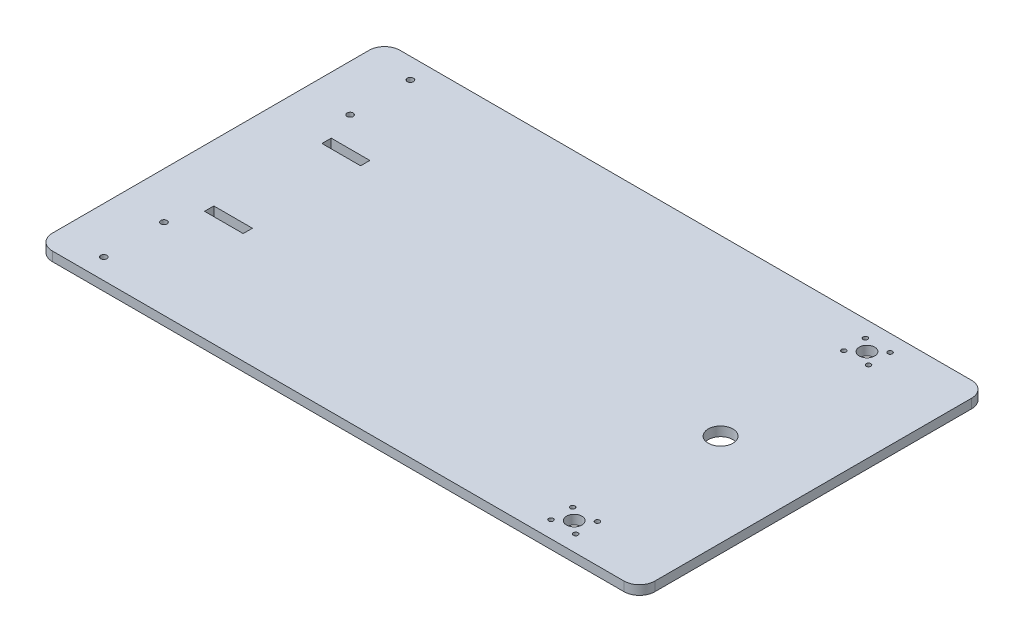
ISO-10303-21;
HEADER;
FILE_DESCRIPTION(('STEP AP214'),'2;1');
FILE_NAME('part.step','',(''),(''),'','','');
FILE_SCHEMA(('AUTOMOTIVE_DESIGN { 1 0 10303 214 1 1 1 1 }'));
ENDSEC;
DATA;
#1=APPLICATION_CONTEXT('core data for automotive mechanical design processes');
#2=APPLICATION_PROTOCOL_DEFINITION('international standard','automotive_design',2000,#1);
#3=PRODUCT_CONTEXT('',#1,'mechanical');
#4=PRODUCT('Part','Part','',(#3));
#5=PRODUCT_RELATED_PRODUCT_CATEGORY('part','',(#4));
#6=PRODUCT_DEFINITION_FORMATION('','',#4);
#7=PRODUCT_DEFINITION_CONTEXT('part definition',#1,'design');
#8=PRODUCT_DEFINITION('design','',#6,#7);
#9=PRODUCT_DEFINITION_SHAPE('','',#8);
#10=(LENGTH_UNIT() NAMED_UNIT(*) SI_UNIT(.MILLI.,.METRE.));
#11=(NAMED_UNIT(*) PLANE_ANGLE_UNIT() SI_UNIT($,.RADIAN.));
#12=(NAMED_UNIT(*) SI_UNIT($,.STERADIAN.) SOLID_ANGLE_UNIT());
#13=UNCERTAINTY_MEASURE_WITH_UNIT(LENGTH_MEASURE(1.E-05),#10,'distance_accuracy_value','');
#14=(GEOMETRIC_REPRESENTATION_CONTEXT(3) GLOBAL_UNCERTAINTY_ASSIGNED_CONTEXT((#13)) GLOBAL_UNIT_ASSIGNED_CONTEXT((#10,
#11,#12)) REPRESENTATION_CONTEXT('',''));
#15=CARTESIAN_POINT('',(0.,0.,0.));
#16=DIRECTION('',(0.,0.,1.));
#17=DIRECTION('',(1.,0.,0.));
#18=AXIS2_PLACEMENT_3D('',#15,#16,#17);
#19=CARTESIAN_POINT('',(-185.,6.,-102.5));
#20=DIRECTION('',(0.,1.,0.));
#21=DIRECTION('',(0.,0.,1.));
#22=AXIS2_PLACEMENT_3D('',#19,#20,#21);
#23=PLANE('',#22);
#24=CARTESIAN_POINT('',(-165.,6.,-60.2500000000001));
#25=DIRECTION('',(0.,1.,0.));
#26=DIRECTION('',(0.,0.,-1.));
#27=AXIS2_PLACEMENT_3D('',#24,#25,#26);
#28=CIRCLE('',#27,2.);
#29=CARTESIAN_POINT('',(-165.,6.,-62.25));
#30=VERTEX_POINT('',#29);
#31=EDGE_CURVE('E450',#30,#30,#28,.T.);
#32=ORIENTED_EDGE('',*,*,#31,.F.);
#33=EDGE_LOOP('',(#32));
#34=FACE_BOUND('',#33,.T.);
#35=CARTESIAN_POINT('',(-165.,6.,60.25));
#36=DIRECTION('',(0.,1.,0.));
#37=DIRECTION('',(0.,0.,1.));
#38=AXIS2_PLACEMENT_3D('',#35,#36,#37);
#39=CIRCLE('',#38,2.);
#40=CARTESIAN_POINT('',(-165.,6.,62.25));
#41=VERTEX_POINT('',#40);
#42=EDGE_CURVE('E462',#41,#41,#39,.T.);
#43=ORIENTED_EDGE('',*,*,#42,.F.);
#44=EDGE_LOOP('',(#43));
#45=FACE_BOUND('',#44,.T.);
#46=CARTESIAN_POINT('',(127.,6.,-87.7500000000001));
#47=DIRECTION('',(0.,1.,0.));
#48=DIRECTION('',(0.,0.,1.));
#49=AXIS2_PLACEMENT_3D('',#46,#47,#48);
#50=CIRCLE('',#49,1.49999999999997);
#51=CARTESIAN_POINT('',(127.,6.,-86.2500000000002));
#52=VERTEX_POINT('',#51);
#53=EDGE_CURVE('E474',#52,#52,#50,.T.);
#54=ORIENTED_EDGE('',*,*,#53,.F.);
#55=EDGE_LOOP('',(#54));
#56=FACE_BOUND('',#55,.T.);
#57=CARTESIAN_POINT('',(143.,6.,-87.7500000000001));
#58=DIRECTION('',(0.,1.,0.));
#59=DIRECTION('',(0.,0.,-1.));
#60=AXIS2_PLACEMENT_3D('',#57,#58,#59);
#61=CIRCLE('',#60,1.5);
#62=CARTESIAN_POINT('',(143.,6.,-89.2500000000001));
#63=VERTEX_POINT('',#62);
#64=EDGE_CURVE('E486',#63,#63,#61,.T.);
#65=ORIENTED_EDGE('',*,*,#64,.F.);
#66=EDGE_LOOP('',(#65));
#67=FACE_BOUND('',#66,.T.);
#68=CARTESIAN_POINT('',(127.,6.,87.7500000000001));
#69=DIRECTION('',(0.,1.,0.));
#70=DIRECTION('',(0.,0.,-1.));
#71=AXIS2_PLACEMENT_3D('',#68,#69,#70);
#72=CIRCLE('',#71,1.49999999999997);
#73=CARTESIAN_POINT('',(127.,6.,86.2500000000001));
#74=VERTEX_POINT('',#73);
#75=EDGE_CURVE('E498',#74,#74,#72,.T.);
#76=ORIENTED_EDGE('',*,*,#75,.F.);
#77=EDGE_LOOP('',(#76));
#78=FACE_BOUND('',#77,.T.);
#79=CARTESIAN_POINT('',(127.,6.,101.75));
#80=DIRECTION('',(0.,1.,0.));
#81=DIRECTION('',(0.,0.,-1.));
#82=AXIS2_PLACEMENT_3D('',#79,#80,#81);
#83=CIRCLE('',#82,1.50000000000002);
#84=CARTESIAN_POINT('',(127.,6.,100.25));
#85=VERTEX_POINT('',#84);
#86=EDGE_CURVE('E510',#85,#85,#83,.T.);
#87=ORIENTED_EDGE('',*,*,#86,.F.);
#88=EDGE_LOOP('',(#87));
#89=FACE_BOUND('',#88,.T.);
#90=CARTESIAN_POINT('',(135.,6.,94.7500000000001));
#91=DIRECTION('',(0.,1.,0.));
#92=DIRECTION('',(0.,0.,1.));
#93=AXIS2_PLACEMENT_3D('',#90,#91,#92);
#94=CIRCLE('',#93,4.99999999999999);
#95=CARTESIAN_POINT('',(135.,6.,99.7500000000001));
#96=VERTEX_POINT('',#95);
#97=EDGE_CURVE('E522',#96,#96,#94,.T.);
#98=ORIENTED_EDGE('',*,*,#97,.F.);
#99=EDGE_LOOP('',(#98));
#100=FACE_BOUND('',#99,.T.);
#101=DIRECTION('',(0.,0.,1.));
#102=VECTOR('',#101,1.);
#103=CARTESIAN_POINT('',(-158.,6.,41.));
#104=LINE('',#103,#102);
#105=CARTESIAN_POINT('',(-158.,6.,35.));
#106=VERTEX_POINT('',#105);
#107=CARTESIAN_POINT('',(-158.,6.,41.));
#108=VERTEX_POINT('',#107);
#109=EDGE_CURVE('E159',#106,#108,#104,.T.);
#110=ORIENTED_EDGE('',*,*,#109,.F.);
#111=DIRECTION('',(-1.,0.,0.));
#112=VECTOR('',#111,1.);
#113=CARTESIAN_POINT('',(-158.,6.,35.));
#114=LINE('',#113,#112);
#115=CARTESIAN_POINT('',(-133.,6.,35.));
#116=VERTEX_POINT('',#115);
#117=EDGE_CURVE('E151',#116,#106,#114,.T.);
#118=ORIENTED_EDGE('',*,*,#117,.F.);
#119=DIRECTION('',(0.,0.,-1.));
#120=VECTOR('',#119,1.);
#121=CARTESIAN_POINT('',(-133.,6.,35.));
#122=LINE('',#121,#120);
#123=CARTESIAN_POINT('',(-133.,6.,41.));
#124=VERTEX_POINT('',#123);
#125=EDGE_CURVE('E174',#124,#116,#122,.T.);
#126=ORIENTED_EDGE('',*,*,#125,.F.);
#127=DIRECTION('',(1.,0.,0.));
#128=VECTOR('',#127,1.);
#129=CARTESIAN_POINT('',(-133.,6.,41.));
#130=LINE('',#129,#128);
#131=EDGE_CURVE('E172',#108,#124,#130,.T.);
#132=ORIENTED_EDGE('',*,*,#131,.F.);
#133=EDGE_LOOP('',(#110,#118,#126,#132));
#134=FACE_BOUND('',#133,.T.);
#135=DIRECTION('',(0.,0.,1.));
#136=VECTOR('',#135,1.);
#137=CARTESIAN_POINT('',(-158.,6.,-41.));
#138=LINE('',#137,#136);
#139=CARTESIAN_POINT('',(-158.,6.,-41.));
#140=VERTEX_POINT('',#139);
#141=CARTESIAN_POINT('',(-158.,6.,-35.));
#142=VERTEX_POINT('',#141);
#143=EDGE_CURVE('E192',#140,#142,#138,.T.);
#144=ORIENTED_EDGE('',*,*,#143,.F.);
#145=DIRECTION('',(-1.,0.,0.));
#146=VECTOR('',#145,1.);
#147=CARTESIAN_POINT('',(-133.,6.,-41.));
#148=LINE('',#147,#146);
#149=CARTESIAN_POINT('',(-133.,6.,-41.));
#150=VERTEX_POINT('',#149);
#151=EDGE_CURVE('E190',#150,#140,#148,.T.);
#152=ORIENTED_EDGE('',*,*,#151,.F.);
#153=DIRECTION('',(0.,0.,-1.));
#154=VECTOR('',#153,1.);
#155=CARTESIAN_POINT('',(-133.,6.,-35.));
#156=LINE('',#155,#154);
#157=CARTESIAN_POINT('',(-133.,6.,-35.));
#158=VERTEX_POINT('',#157);
#159=EDGE_CURVE('E198',#158,#150,#156,.T.);
#160=ORIENTED_EDGE('',*,*,#159,.F.);
#161=DIRECTION('',(1.,0.,0.));
#162=VECTOR('',#161,1.);
#163=CARTESIAN_POINT('',(-158.,6.,-35.));
#164=LINE('',#163,#162);
#165=EDGE_CURVE('E195',#142,#158,#164,.T.);
#166=ORIENTED_EDGE('',*,*,#165,.F.);
#167=EDGE_LOOP('',(#144,#152,#160,#166));
#168=FACE_BOUND('',#167,.T.);
#169=CARTESIAN_POINT('',(-185.,6.,-102.5));
#170=DIRECTION('',(0.,1.,0.));
#171=DIRECTION('',(0.,0.,1.));
#172=AXIS2_PLACEMENT_3D('',#169,#170,#171);
#173=CIRCLE('',#172,10.);
#174=CARTESIAN_POINT('',(-185.,6.,-112.5));
#175=VERTEX_POINT('',#174);
#176=CARTESIAN_POINT('',(-195.,6.,-102.5));
#177=VERTEX_POINT('',#176);
#178=EDGE_CURVE('E221',#175,#177,#173,.T.);
#179=ORIENTED_EDGE('',*,*,#178,.T.);
#180=DIRECTION('',(0.,0.,1.));
#181=VECTOR('',#180,1.);
#182=CARTESIAN_POINT('',(-195.,6.,-102.5));
#183=LINE('',#182,#181);
#184=CARTESIAN_POINT('',(-195.,6.,102.5));
#185=VERTEX_POINT('',#184);
#186=EDGE_CURVE('E224',#177,#185,#183,.T.);
#187=ORIENTED_EDGE('',*,*,#186,.T.);
#188=CARTESIAN_POINT('',(-185.,6.,102.5));
#189=DIRECTION('',(0.,1.,0.));
#190=DIRECTION('',(0.,0.,1.));
#191=AXIS2_PLACEMENT_3D('',#188,#189,#190);
#192=CIRCLE('',#191,10.);
#193=CARTESIAN_POINT('',(-185.,6.,112.5));
#194=VERTEX_POINT('',#193);
#195=EDGE_CURVE('E227',#185,#194,#192,.T.);
#196=ORIENTED_EDGE('',*,*,#195,.T.);
#197=DIRECTION('',(1.,0.,0.));
#198=VECTOR('',#197,1.);
#199=CARTESIAN_POINT('',(-185.,6.,112.5));
#200=LINE('',#199,#198);
#201=CARTESIAN_POINT('',(185.,6.,112.5));
#202=VERTEX_POINT('',#201);
#203=EDGE_CURVE('E229',#194,#202,#200,.T.);
#204=ORIENTED_EDGE('',*,*,#203,.T.);
#205=CARTESIAN_POINT('',(185.,6.,102.5));
#206=DIRECTION('',(0.,1.,0.));
#207=DIRECTION('',(0.,0.,1.));
#208=AXIS2_PLACEMENT_3D('',#205,#206,#207);
#209=CIRCLE('',#208,10.);
#210=CARTESIAN_POINT('',(195.,6.,102.5));
#211=VERTEX_POINT('',#210);
#212=EDGE_CURVE('E231',#202,#211,#209,.T.);
#213=ORIENTED_EDGE('',*,*,#212,.T.);
#214=DIRECTION('',(0.,0.,-1.));
#215=VECTOR('',#214,1.);
#216=CARTESIAN_POINT('',(195.,6.,-102.5));
#217=LINE('',#216,#215);
#218=CARTESIAN_POINT('',(195.,6.,-102.5));
#219=VERTEX_POINT('',#218);
#220=EDGE_CURVE('E233',#211,#219,#217,.T.);
#221=ORIENTED_EDGE('',*,*,#220,.T.);
#222=CARTESIAN_POINT('',(185.,6.,-102.5));
#223=DIRECTION('',(0.,1.,0.));
#224=DIRECTION('',(0.,0.,-1.));
#225=AXIS2_PLACEMENT_3D('',#222,#223,#224);
#226=CIRCLE('',#225,10.);
#227=CARTESIAN_POINT('',(185.,6.,-112.5));
#228=VERTEX_POINT('',#227);
#229=EDGE_CURVE('E235',#219,#228,#226,.T.);
#230=ORIENTED_EDGE('',*,*,#229,.T.);
#231=DIRECTION('',(-1.,0.,0.));
#232=VECTOR('',#231,1.);
#233=CARTESIAN_POINT('',(-185.,6.,-112.5));
#234=LINE('',#233,#232);
#235=EDGE_CURVE('E237',#228,#175,#234,.T.);
#236=ORIENTED_EDGE('',*,*,#235,.T.);
#237=EDGE_LOOP('',(#179,#187,#196,#204,#213,#221,#230,#236));
#238=FACE_BOUND('',#237,.T.);
#239=CARTESIAN_POINT('',(135.,6.,0.));
#240=DIRECTION('',(0.,1.,0.));
#241=DIRECTION('',(0.,0.,1.));
#242=AXIS2_PLACEMENT_3D('',#239,#240,#241);
#243=CIRCLE('',#242,8.00000000000001);
#244=CARTESIAN_POINT('',(135.,6.,8.00000000000001));
#245=VERTEX_POINT('',#244);
#246=EDGE_CURVE('E180',#245,#245,#243,.T.);
#247=ORIENTED_EDGE('',*,*,#246,.F.);
#248=EDGE_LOOP('',(#247));
#249=FACE_BOUND('',#248,.T.);
#250=CARTESIAN_POINT('',(143.,6.,87.7500000000001));
#251=DIRECTION('',(0.,1.,0.));
#252=DIRECTION('',(0.,0.,1.));
#253=AXIS2_PLACEMENT_3D('',#250,#251,#252);
#254=CIRCLE('',#253,1.5);
#255=CARTESIAN_POINT('',(143.,6.,89.2500000000001));
#256=VERTEX_POINT('',#255);
#257=EDGE_CURVE('E516',#256,#256,#254,.T.);
#258=ORIENTED_EDGE('',*,*,#257,.F.);
#259=EDGE_LOOP('',(#258));
#260=FACE_BOUND('',#259,.T.);
#261=CARTESIAN_POINT('',(143.,6.,101.75));
#262=DIRECTION('',(0.,1.,0.));
#263=DIRECTION('',(0.,0.,1.));
#264=AXIS2_PLACEMENT_3D('',#261,#262,#263);
#265=CIRCLE('',#264,1.5);
#266=CARTESIAN_POINT('',(143.,6.,103.25));
#267=VERTEX_POINT('',#266);
#268=EDGE_CURVE('E504',#267,#267,#265,.T.);
#269=ORIENTED_EDGE('',*,*,#268,.F.);
#270=EDGE_LOOP('',(#269));
#271=FACE_BOUND('',#270,.T.);
#272=CARTESIAN_POINT('',(143.,6.,-101.75));
#273=DIRECTION('',(0.,1.,0.));
#274=DIRECTION('',(0.,0.,-1.));
#275=AXIS2_PLACEMENT_3D('',#272,#273,#274);
#276=CIRCLE('',#275,1.5);
#277=CARTESIAN_POINT('',(143.,6.,-103.25));
#278=VERTEX_POINT('',#277);
#279=EDGE_CURVE('E492',#278,#278,#276,.T.);
#280=ORIENTED_EDGE('',*,*,#279,.F.);
#281=EDGE_LOOP('',(#280));
#282=FACE_BOUND('',#281,.T.);
#283=CARTESIAN_POINT('',(127.,6.,-101.75));
#284=DIRECTION('',(0.,1.,0.));
#285=DIRECTION('',(0.,0.,1.));
#286=AXIS2_PLACEMENT_3D('',#283,#284,#285);
#287=CIRCLE('',#286,1.50000000000002);
#288=CARTESIAN_POINT('',(127.,6.,-100.25));
#289=VERTEX_POINT('',#288);
#290=EDGE_CURVE('E480',#289,#289,#287,.T.);
#291=ORIENTED_EDGE('',*,*,#290,.F.);
#292=EDGE_LOOP('',(#291));
#293=FACE_BOUND('',#292,.T.);
#294=CARTESIAN_POINT('',(135.,6.,-94.7500000000001));
#295=DIRECTION('',(0.,1.,0.));
#296=DIRECTION('',(0.,0.,-1.));
#297=AXIS2_PLACEMENT_3D('',#294,#295,#296);
#298=CIRCLE('',#297,4.99999999999999);
#299=CARTESIAN_POINT('',(135.,6.,-99.7500000000001));
#300=VERTEX_POINT('',#299);
#301=EDGE_CURVE('E468',#300,#300,#298,.T.);
#302=ORIENTED_EDGE('',*,*,#301,.F.);
#303=EDGE_LOOP('',(#302));
#304=FACE_BOUND('',#303,.T.);
#305=CARTESIAN_POINT('',(-165.,6.,99.25));
#306=DIRECTION('',(0.,1.,0.));
#307=DIRECTION('',(0.,0.,1.));
#308=AXIS2_PLACEMENT_3D('',#305,#306,#307);
#309=CIRCLE('',#308,2.);
#310=CARTESIAN_POINT('',(-165.,6.,101.25));
#311=VERTEX_POINT('',#310);
#312=EDGE_CURVE('E456',#311,#311,#309,.T.);
#313=ORIENTED_EDGE('',*,*,#312,.F.);
#314=EDGE_LOOP('',(#313));
#315=FACE_BOUND('',#314,.T.);
#316=CARTESIAN_POINT('',(-165.,6.,-99.2500000000001));
#317=DIRECTION('',(0.,1.,0.));
#318=DIRECTION('',(0.,0.,-1.));
#319=AXIS2_PLACEMENT_3D('',#316,#317,#318);
#320=CIRCLE('',#319,2.);
#321=CARTESIAN_POINT('',(-165.,6.,-101.25));
#322=VERTEX_POINT('',#321);
#323=EDGE_CURVE('E441',#322,#322,#320,.T.);
#324=ORIENTED_EDGE('',*,*,#323,.F.);
#325=EDGE_LOOP('',(#324));
#326=FACE_BOUND('',#325,.T.);
#327=ADVANCED_FACE('F38',(#34,#45,#56,#67,#78,#89,#100,#134,#168,#238,#249,#260,#271,#282,#293,
#304,#315,#326),#23,.T.);
#328=CARTESIAN_POINT('',(-185.,0.,-102.5));
#329=DIRECTION('',(0.,1.,0.));
#330=DIRECTION('',(0.,0.,1.));
#331=AXIS2_PLACEMENT_3D('',#328,#329,#330);
#332=PLANE('',#331);
#333=DIRECTION('',(-1.,0.,0.));
#334=VECTOR('',#333,1.);
#335=CARTESIAN_POINT('',(-133.,0.,-41.));
#336=LINE('',#335,#334);
#337=CARTESIAN_POINT('',(-133.,0.,-41.));
#338=VERTEX_POINT('',#337);
#339=CARTESIAN_POINT('',(-158.,0.,-41.));
#340=VERTEX_POINT('',#339);
#341=EDGE_CURVE('E167',#338,#340,#336,.T.);
#342=ORIENTED_EDGE('',*,*,#341,.T.);
#343=DIRECTION('',(0.,0.,1.));
#344=VECTOR('',#343,1.);
#345=CARTESIAN_POINT('',(-158.,0.,-41.));
#346=LINE('',#345,#344);
#347=CARTESIAN_POINT('',(-158.,0.,-35.));
#348=VERTEX_POINT('',#347);
#349=EDGE_CURVE('E203',#340,#348,#346,.T.);
#350=ORIENTED_EDGE('',*,*,#349,.T.);
#351=DIRECTION('',(1.,0.,0.));
#352=VECTOR('',#351,1.);
#353=CARTESIAN_POINT('',(-158.,0.,-35.));
#354=LINE('',#353,#352);
#355=CARTESIAN_POINT('',(-133.,0.,-35.));
#356=VERTEX_POINT('',#355);
#357=EDGE_CURVE('E206',#348,#356,#354,.T.);
#358=ORIENTED_EDGE('',*,*,#357,.T.);
#359=DIRECTION('',(0.,0.,-1.));
#360=VECTOR('',#359,1.);
#361=CARTESIAN_POINT('',(-133.,0.,-35.));
#362=LINE('',#361,#360);
#363=EDGE_CURVE('E193',#356,#338,#362,.T.);
#364=ORIENTED_EDGE('',*,*,#363,.T.);
#365=EDGE_LOOP('',(#342,#350,#358,#364));
#366=FACE_BOUND('',#365,.T.);
#367=CARTESIAN_POINT('',(-185.,0.,-102.5));
#368=DIRECTION('',(0.,1.,0.));
#369=DIRECTION('',(0.,0.,1.));
#370=AXIS2_PLACEMENT_3D('',#367,#368,#369);
#371=CIRCLE('',#370,10.);
#372=CARTESIAN_POINT('',(-185.,0.,-112.5));
#373=VERTEX_POINT('',#372);
#374=CARTESIAN_POINT('',(-195.,0.,-102.5));
#375=VERTEX_POINT('',#374);
#376=EDGE_CURVE('E220',#373,#375,#371,.T.);
#377=ORIENTED_EDGE('',*,*,#376,.F.);
#378=DIRECTION('',(-1.,0.,0.));
#379=VECTOR('',#378,1.);
#380=CARTESIAN_POINT('',(-185.,0.,-112.5));
#381=LINE('',#380,#379);
#382=CARTESIAN_POINT('',(185.,0.,-112.5));
#383=VERTEX_POINT('',#382);
#384=EDGE_CURVE('E225',#383,#373,#381,.T.);
#385=ORIENTED_EDGE('',*,*,#384,.F.);
#386=CARTESIAN_POINT('',(185.,0.,-102.5));
#387=DIRECTION('',(0.,1.,0.));
#388=DIRECTION('',(0.,0.,-1.));
#389=AXIS2_PLACEMENT_3D('',#386,#387,#388);
#390=CIRCLE('',#389,10.);
#391=CARTESIAN_POINT('',(195.,0.,-102.5));
#392=VERTEX_POINT('',#391);
#393=EDGE_CURVE('E252',#392,#383,#390,.T.);
#394=ORIENTED_EDGE('',*,*,#393,.F.);
#395=DIRECTION('',(0.,0.,-1.));
#396=VECTOR('',#395,1.);
#397=CARTESIAN_POINT('',(195.,0.,-102.5));
#398=LINE('',#397,#396);
#399=CARTESIAN_POINT('',(195.,0.,102.5));
#400=VERTEX_POINT('',#399);
#401=EDGE_CURVE('E250',#400,#392,#398,.T.);
#402=ORIENTED_EDGE('',*,*,#401,.F.);
#403=CARTESIAN_POINT('',(185.,0.,102.5));
#404=DIRECTION('',(0.,1.,0.));
#405=DIRECTION('',(0.,0.,1.));
#406=AXIS2_PLACEMENT_3D('',#403,#404,#405);
#407=CIRCLE('',#406,10.);
#408=CARTESIAN_POINT('',(185.,0.,112.5));
#409=VERTEX_POINT('',#408);
#410=EDGE_CURVE('E248',#409,#400,#407,.T.);
#411=ORIENTED_EDGE('',*,*,#410,.F.);
#412=DIRECTION('',(1.,0.,0.));
#413=VECTOR('',#412,1.);
#414=CARTESIAN_POINT('',(-185.,0.,112.5));
#415=LINE('',#414,#413);
#416=CARTESIAN_POINT('',(-185.,0.,112.5));
#417=VERTEX_POINT('',#416);
#418=EDGE_CURVE('E246',#417,#409,#415,.T.);
#419=ORIENTED_EDGE('',*,*,#418,.F.);
#420=CARTESIAN_POINT('',(-185.,0.,102.5));
#421=DIRECTION('',(0.,1.,0.));
#422=DIRECTION('',(0.,0.,1.));
#423=AXIS2_PLACEMENT_3D('',#420,#421,#422);
#424=CIRCLE('',#423,10.);
#425=CARTESIAN_POINT('',(-195.,0.,102.5));
#426=VERTEX_POINT('',#425);
#427=EDGE_CURVE('E244',#426,#417,#424,.T.);
#428=ORIENTED_EDGE('',*,*,#427,.F.);
#429=DIRECTION('',(0.,0.,1.));
#430=VECTOR('',#429,1.);
#431=CARTESIAN_POINT('',(-195.,0.,-102.5));
#432=LINE('',#431,#430);
#433=EDGE_CURVE('E242',#375,#426,#432,.T.);
#434=ORIENTED_EDGE('',*,*,#433,.F.);
#435=EDGE_LOOP('',(#377,#385,#394,#402,#411,#419,#428,#434));
#436=FACE_BOUND('',#435,.T.);
#437=DIRECTION('',(-1.,0.,0.));
#438=VECTOR('',#437,1.);
#439=CARTESIAN_POINT('',(-158.,0.,35.));
#440=LINE('',#439,#438);
#441=CARTESIAN_POINT('',(-133.,0.,35.));
#442=VERTEX_POINT('',#441);
#443=CARTESIAN_POINT('',(-158.,0.,35.));
#444=VERTEX_POINT('',#443);
#445=EDGE_CURVE('E61',#442,#444,#440,.T.);
#446=ORIENTED_EDGE('',*,*,#445,.T.);
#447=DIRECTION('',(0.,0.,1.));
#448=VECTOR('',#447,1.);
#449=CARTESIAN_POINT('',(-158.,0.,41.));
#450=LINE('',#449,#448);
#451=CARTESIAN_POINT('',(-158.,0.,41.));
#452=VERTEX_POINT('',#451);
#453=EDGE_CURVE('E166',#444,#452,#450,.T.);
#454=ORIENTED_EDGE('',*,*,#453,.T.);
#455=DIRECTION('',(1.,0.,0.));
#456=VECTOR('',#455,1.);
#457=CARTESIAN_POINT('',(-133.,0.,41.));
#458=LINE('',#457,#456);
#459=CARTESIAN_POINT('',(-133.,0.,41.));
#460=VERTEX_POINT('',#459);
#461=EDGE_CURVE('E182',#452,#460,#458,.T.);
#462=ORIENTED_EDGE('',*,*,#461,.T.);
#463=DIRECTION('',(0.,0.,-1.));
#464=VECTOR('',#463,1.);
#465=CARTESIAN_POINT('',(-133.,0.,35.));
#466=LINE('',#465,#464);
#467=EDGE_CURVE('E160',#460,#442,#466,.T.);
#468=ORIENTED_EDGE('',*,*,#467,.T.);
#469=EDGE_LOOP('',(#446,#454,#462,#468));
#470=FACE_BOUND('',#469,.T.);
#471=CARTESIAN_POINT('',(135.,0.,0.));
#472=DIRECTION('',(0.,1.,0.));
#473=DIRECTION('',(0.,0.,1.));
#474=AXIS2_PLACEMENT_3D('',#471,#472,#473);
#475=CIRCLE('',#474,8.00000000000001);
#476=CARTESIAN_POINT('',(135.,0.,8.00000000000001));
#477=VERTEX_POINT('',#476);
#478=EDGE_CURVE('E525',#477,#477,#475,.T.);
#479=ORIENTED_EDGE('',*,*,#478,.T.);
#480=EDGE_LOOP('',(#479));
#481=FACE_BOUND('',#480,.T.);
#482=CARTESIAN_POINT('',(135.,0.,94.7500000000001));
#483=DIRECTION('',(0.,1.,0.));
#484=DIRECTION('',(0.,0.,1.));
#485=AXIS2_PLACEMENT_3D('',#482,#483,#484);
#486=CIRCLE('',#485,4.99999999999999);
#487=CARTESIAN_POINT('',(135.,0.,99.7500000000001));
#488=VERTEX_POINT('',#487);
#489=EDGE_CURVE('E519',#488,#488,#486,.T.);
#490=ORIENTED_EDGE('',*,*,#489,.T.);
#491=EDGE_LOOP('',(#490));
#492=FACE_BOUND('',#491,.T.);
#493=CARTESIAN_POINT('',(143.,0.,87.7500000000001));
#494=DIRECTION('',(0.,1.,0.));
#495=DIRECTION('',(0.,0.,1.));
#496=AXIS2_PLACEMENT_3D('',#493,#494,#495);
#497=CIRCLE('',#496,1.5);
#498=CARTESIAN_POINT('',(143.,0.,89.2500000000001));
#499=VERTEX_POINT('',#498);
#500=EDGE_CURVE('E513',#499,#499,#497,.T.);
#501=ORIENTED_EDGE('',*,*,#500,.T.);
#502=EDGE_LOOP('',(#501));
#503=FACE_BOUND('',#502,.T.);
#504=CARTESIAN_POINT('',(127.,0.,101.75));
#505=DIRECTION('',(0.,1.,0.));
#506=DIRECTION('',(0.,0.,-1.));
#507=AXIS2_PLACEMENT_3D('',#504,#505,#506);
#508=CIRCLE('',#507,1.50000000000002);
#509=CARTESIAN_POINT('',(127.,0.,100.25));
#510=VERTEX_POINT('',#509);
#511=EDGE_CURVE('E507',#510,#510,#508,.T.);
#512=ORIENTED_EDGE('',*,*,#511,.T.);
#513=EDGE_LOOP('',(#512));
#514=FACE_BOUND('',#513,.T.);
#515=CARTESIAN_POINT('',(143.,0.,101.75));
#516=DIRECTION('',(0.,1.,0.));
#517=DIRECTION('',(0.,0.,1.));
#518=AXIS2_PLACEMENT_3D('',#515,#516,#517);
#519=CIRCLE('',#518,1.5);
#520=CARTESIAN_POINT('',(143.,0.,103.25));
#521=VERTEX_POINT('',#520);
#522=EDGE_CURVE('E501',#521,#521,#519,.T.);
#523=ORIENTED_EDGE('',*,*,#522,.T.);
#524=EDGE_LOOP('',(#523));
#525=FACE_BOUND('',#524,.T.);
#526=CARTESIAN_POINT('',(127.,0.,87.7500000000001));
#527=DIRECTION('',(0.,1.,0.));
#528=DIRECTION('',(0.,0.,-1.));
#529=AXIS2_PLACEMENT_3D('',#526,#527,#528);
#530=CIRCLE('',#529,1.49999999999997);
#531=CARTESIAN_POINT('',(127.,0.,86.2500000000001));
#532=VERTEX_POINT('',#531);
#533=EDGE_CURVE('E495',#532,#532,#530,.T.);
#534=ORIENTED_EDGE('',*,*,#533,.T.);
#535=EDGE_LOOP('',(#534));
#536=FACE_BOUND('',#535,.T.);
#537=CARTESIAN_POINT('',(143.,0.,-101.75));
#538=DIRECTION('',(0.,1.,0.));
#539=DIRECTION('',(0.,0.,-1.));
#540=AXIS2_PLACEMENT_3D('',#537,#538,#539);
#541=CIRCLE('',#540,1.5);
#542=CARTESIAN_POINT('',(143.,0.,-103.25));
#543=VERTEX_POINT('',#542);
#544=EDGE_CURVE('E489',#543,#543,#541,.T.);
#545=ORIENTED_EDGE('',*,*,#544,.T.);
#546=EDGE_LOOP('',(#545));
#547=FACE_BOUND('',#546,.T.);
#548=CARTESIAN_POINT('',(143.,0.,-87.7500000000001));
#549=DIRECTION('',(0.,1.,0.));
#550=DIRECTION('',(0.,0.,-1.));
#551=AXIS2_PLACEMENT_3D('',#548,#549,#550);
#552=CIRCLE('',#551,1.5);
#553=CARTESIAN_POINT('',(143.,0.,-89.2500000000001));
#554=VERTEX_POINT('',#553);
#555=EDGE_CURVE('E483',#554,#554,#552,.T.);
#556=ORIENTED_EDGE('',*,*,#555,.T.);
#557=EDGE_LOOP('',(#556));
#558=FACE_BOUND('',#557,.T.);
#559=CARTESIAN_POINT('',(127.,0.,-101.75));
#560=DIRECTION('',(0.,1.,0.));
#561=DIRECTION('',(0.,0.,1.));
#562=AXIS2_PLACEMENT_3D('',#559,#560,#561);
#563=CIRCLE('',#562,1.50000000000002);
#564=CARTESIAN_POINT('',(127.,0.,-100.25));
#565=VERTEX_POINT('',#564);
#566=EDGE_CURVE('E477',#565,#565,#563,.T.);
#567=ORIENTED_EDGE('',*,*,#566,.T.);
#568=EDGE_LOOP('',(#567));
#569=FACE_BOUND('',#568,.T.);
#570=CARTESIAN_POINT('',(127.,0.,-87.7500000000001));
#571=DIRECTION('',(0.,1.,0.));
#572=DIRECTION('',(0.,0.,1.));
#573=AXIS2_PLACEMENT_3D('',#570,#571,#572);
#574=CIRCLE('',#573,1.49999999999997);
#575=CARTESIAN_POINT('',(127.,0.,-86.2500000000002));
#576=VERTEX_POINT('',#575);
#577=EDGE_CURVE('E471',#576,#576,#574,.T.);
#578=ORIENTED_EDGE('',*,*,#577,.T.);
#579=EDGE_LOOP('',(#578));
#580=FACE_BOUND('',#579,.T.);
#581=CARTESIAN_POINT('',(135.,0.,-94.7500000000001));
#582=DIRECTION('',(0.,1.,0.));
#583=DIRECTION('',(0.,0.,-1.));
#584=AXIS2_PLACEMENT_3D('',#581,#582,#583);
#585=CIRCLE('',#584,4.99999999999999);
#586=CARTESIAN_POINT('',(135.,0.,-99.7500000000001));
#587=VERTEX_POINT('',#586);
#588=EDGE_CURVE('E465',#587,#587,#585,.T.);
#589=ORIENTED_EDGE('',*,*,#588,.T.);
#590=EDGE_LOOP('',(#589));
#591=FACE_BOUND('',#590,.T.);
#592=CARTESIAN_POINT('',(-165.,0.,60.25));
#593=DIRECTION('',(0.,1.,0.));
#594=DIRECTION('',(0.,0.,1.));
#595=AXIS2_PLACEMENT_3D('',#592,#593,#594);
#596=CIRCLE('',#595,2.);
#597=CARTESIAN_POINT('',(-165.,0.,62.25));
#598=VERTEX_POINT('',#597);
#599=EDGE_CURVE('E459',#598,#598,#596,.T.);
#600=ORIENTED_EDGE('',*,*,#599,.T.);
#601=EDGE_LOOP('',(#600));
#602=FACE_BOUND('',#601,.T.);
#603=CARTESIAN_POINT('',(-165.,0.,99.25));
#604=DIRECTION('',(0.,1.,0.));
#605=DIRECTION('',(0.,0.,1.));
#606=AXIS2_PLACEMENT_3D('',#603,#604,#605);
#607=CIRCLE('',#606,2.);
#608=CARTESIAN_POINT('',(-165.,0.,101.25));
#609=VERTEX_POINT('',#608);
#610=EDGE_CURVE('E453',#609,#609,#607,.T.);
#611=ORIENTED_EDGE('',*,*,#610,.T.);
#612=EDGE_LOOP('',(#611));
#613=FACE_BOUND('',#612,.T.);
#614=CARTESIAN_POINT('',(-165.,0.,-60.2500000000001));
#615=DIRECTION('',(0.,1.,0.));
#616=DIRECTION('',(0.,0.,-1.));
#617=AXIS2_PLACEMENT_3D('',#614,#615,#616);
#618=CIRCLE('',#617,2.);
#619=CARTESIAN_POINT('',(-165.,0.,-62.25));
#620=VERTEX_POINT('',#619);
#621=EDGE_CURVE('E447',#620,#620,#618,.T.);
#622=ORIENTED_EDGE('',*,*,#621,.T.);
#623=EDGE_LOOP('',(#622));
#624=FACE_BOUND('',#623,.T.);
#625=CARTESIAN_POINT('',(-165.,0.,-99.2500000000001));
#626=DIRECTION('',(0.,1.,0.));
#627=DIRECTION('',(0.,0.,-1.));
#628=AXIS2_PLACEMENT_3D('',#625,#626,#627);
#629=CIRCLE('',#628,2.);
#630=CARTESIAN_POINT('',(-165.,0.,-101.25));
#631=VERTEX_POINT('',#630);
#632=EDGE_CURVE('E444',#631,#631,#629,.T.);
#633=ORIENTED_EDGE('',*,*,#632,.T.);
#634=EDGE_LOOP('',(#633));
#635=FACE_BOUND('',#634,.T.);
#636=ADVANCED_FACE('F282',(#366,#436,#470,#481,#492,#503,#514,#525,#536,#547,#558,#569,#580,
#591,#602,#613,#624,#635),#332,.F.);
#637=CARTESIAN_POINT('',(-185.,6.,-102.5));
#638=DIRECTION('',(0.,-1.,0.));
#639=DIRECTION('',(0.,0.,-1.));
#640=AXIS2_PLACEMENT_3D('',#637,#638,#639);
#641=CYLINDRICAL_SURFACE('',#640,10.);
#642=ORIENTED_EDGE('',*,*,#376,.T.);
#643=DIRECTION('',(0.,-1.,0.));
#644=VECTOR('',#643,1.);
#645=CARTESIAN_POINT('',(-195.,6.,-102.5));
#646=LINE('',#645,#644);
#647=EDGE_CURVE('E11',#177,#375,#646,.T.);
#648=ORIENTED_EDGE('',*,*,#647,.F.);
#649=ORIENTED_EDGE('',*,*,#178,.F.);
#650=DIRECTION('',(0.,-1.,0.));
#651=VECTOR('',#650,1.);
#652=CARTESIAN_POINT('',(-185.,6.,-112.5));
#653=LINE('',#652,#651);
#654=EDGE_CURVE('E239',#175,#373,#653,.T.);
#655=ORIENTED_EDGE('',*,*,#654,.T.);
#656=EDGE_LOOP('',(#642,#648,#649,#655));
#657=FACE_BOUND('',#656,.T.);
#658=ADVANCED_FACE('F40',(#657),#641,.T.);
#659=CARTESIAN_POINT('',(-195.,6.,-102.5));
#660=DIRECTION('',(1.,0.,0.));
#661=DIRECTION('',(0.,0.,-1.));
#662=AXIS2_PLACEMENT_3D('',#659,#660,#661);
#663=PLANE('',#662);
#664=ORIENTED_EDGE('',*,*,#433,.T.);
#665=DIRECTION('',(0.,-1.,0.));
#666=VECTOR('',#665,1.);
#667=CARTESIAN_POINT('',(-195.,6.,102.5));
#668=LINE('',#667,#666);
#669=EDGE_CURVE('E46',#185,#426,#668,.T.);
#670=ORIENTED_EDGE('',*,*,#669,.F.);
#671=ORIENTED_EDGE('',*,*,#186,.F.);
#672=ORIENTED_EDGE('',*,*,#647,.T.);
#673=EDGE_LOOP('',(#664,#670,#671,#672));
#674=FACE_BOUND('',#673,.T.);
#675=ADVANCED_FACE('F300',(#674),#663,.F.);
#676=CARTESIAN_POINT('',(-185.,6.,102.5));
#677=DIRECTION('',(0.,-1.,0.));
#678=DIRECTION('',(0.,0.,-1.));
#679=AXIS2_PLACEMENT_3D('',#676,#677,#678);
#680=CYLINDRICAL_SURFACE('',#679,10.);
#681=ORIENTED_EDGE('',*,*,#427,.T.);
#682=DIRECTION('',(0.,-1.,0.));
#683=VECTOR('',#682,1.);
#684=CARTESIAN_POINT('',(-185.,6.,112.5));
#685=LINE('',#684,#683);
#686=EDGE_CURVE('E269',#194,#417,#685,.T.);
#687=ORIENTED_EDGE('',*,*,#686,.F.);
#688=ORIENTED_EDGE('',*,*,#195,.F.);
#689=ORIENTED_EDGE('',*,*,#669,.T.);
#690=EDGE_LOOP('',(#681,#687,#688,#689));
#691=FACE_BOUND('',#690,.T.);
#692=ADVANCED_FACE('F276',(#691),#680,.T.);
#693=CARTESIAN_POINT('',(-185.,6.,112.5));
#694=DIRECTION('',(0.,0.,-1.));
#695=DIRECTION('',(-1.,0.,0.));
#696=AXIS2_PLACEMENT_3D('',#693,#694,#695);
#697=PLANE('',#696);
#698=ORIENTED_EDGE('',*,*,#418,.T.);
#699=DIRECTION('',(0.,-1.,0.));
#700=VECTOR('',#699,1.);
#701=CARTESIAN_POINT('',(185.,6.,112.5));
#702=LINE('',#701,#700);
#703=EDGE_CURVE('E266',#202,#409,#702,.T.);
#704=ORIENTED_EDGE('',*,*,#703,.F.);
#705=ORIENTED_EDGE('',*,*,#203,.F.);
#706=ORIENTED_EDGE('',*,*,#686,.T.);
#707=EDGE_LOOP('',(#698,#704,#705,#706));
#708=FACE_BOUND('',#707,.T.);
#709=ADVANCED_FACE('F288',(#708),#697,.F.);
#710=CARTESIAN_POINT('',(185.,6.,102.5));
#711=DIRECTION('',(0.,-1.,0.));
#712=DIRECTION('',(0.,0.,-1.));
#713=AXIS2_PLACEMENT_3D('',#710,#711,#712);
#714=CYLINDRICAL_SURFACE('',#713,10.);
#715=ORIENTED_EDGE('',*,*,#410,.T.);
#716=DIRECTION('',(0.,-1.,0.));
#717=VECTOR('',#716,1.);
#718=CARTESIAN_POINT('',(195.,6.,102.5));
#719=LINE('',#718,#717);
#720=EDGE_CURVE('E263',#211,#400,#719,.T.);
#721=ORIENTED_EDGE('',*,*,#720,.F.);
#722=ORIENTED_EDGE('',*,*,#212,.F.);
#723=ORIENTED_EDGE('',*,*,#703,.T.);
#724=EDGE_LOOP('',(#715,#721,#722,#723));
#725=FACE_BOUND('',#724,.T.);
#726=ADVANCED_FACE('F292',(#725),#714,.T.);
#727=CARTESIAN_POINT('',(195.,6.,-102.5));
#728=DIRECTION('',(-1.,0.,0.));
#729=DIRECTION('',(0.,0.,1.));
#730=AXIS2_PLACEMENT_3D('',#727,#728,#729);
#731=PLANE('',#730);
#732=ORIENTED_EDGE('',*,*,#401,.T.);
#733=DIRECTION('',(0.,-1.,0.));
#734=VECTOR('',#733,1.);
#735=CARTESIAN_POINT('',(195.,6.,-102.5));
#736=LINE('',#735,#734);
#737=EDGE_CURVE('E260',#219,#392,#736,.T.);
#738=ORIENTED_EDGE('',*,*,#737,.F.);
#739=ORIENTED_EDGE('',*,*,#220,.F.);
#740=ORIENTED_EDGE('',*,*,#720,.T.);
#741=EDGE_LOOP('',(#732,#738,#739,#740));
#742=FACE_BOUND('',#741,.T.);
#743=ADVANCED_FACE('F313',(#742),#731,.F.);
#744=CARTESIAN_POINT('',(185.,6.,-102.5));
#745=DIRECTION('',(0.,-1.,0.));
#746=DIRECTION('',(0.,0.,-1.));
#747=AXIS2_PLACEMENT_3D('',#744,#745,#746);
#748=CYLINDRICAL_SURFACE('',#747,10.);
#749=ORIENTED_EDGE('',*,*,#393,.T.);
#750=DIRECTION('',(0.,-1.,0.));
#751=VECTOR('',#750,1.);
#752=CARTESIAN_POINT('',(185.,6.,-112.5));
#753=LINE('',#752,#751);
#754=EDGE_CURVE('E257',#228,#383,#753,.T.);
#755=ORIENTED_EDGE('',*,*,#754,.F.);
#756=ORIENTED_EDGE('',*,*,#229,.F.);
#757=ORIENTED_EDGE('',*,*,#737,.T.);
#758=EDGE_LOOP('',(#749,#755,#756,#757));
#759=FACE_BOUND('',#758,.T.);
#760=ADVANCED_FACE('F311',(#759),#748,.T.);
#761=CARTESIAN_POINT('',(-185.,6.,-112.5));
#762=DIRECTION('',(0.,0.,1.));
#763=DIRECTION('',(1.,0.,0.));
#764=AXIS2_PLACEMENT_3D('',#761,#762,#763);
#765=PLANE('',#764);
#766=ORIENTED_EDGE('',*,*,#384,.T.);
#767=ORIENTED_EDGE('',*,*,#654,.F.);
#768=ORIENTED_EDGE('',*,*,#235,.F.);
#769=ORIENTED_EDGE('',*,*,#754,.T.);
#770=EDGE_LOOP('',(#766,#767,#768,#769));
#771=FACE_BOUND('',#770,.T.);
#772=ADVANCED_FACE('F306',(#771),#765,.F.);
#773=CARTESIAN_POINT('',(-133.,6.,-41.));
#774=DIRECTION('',(0.,0.,1.));
#775=DIRECTION('',(1.,0.,0.));
#776=AXIS2_PLACEMENT_3D('',#773,#774,#775);
#777=PLANE('',#776);
#778=ORIENTED_EDGE('',*,*,#341,.F.);
#779=DIRECTION('',(0.,-1.,0.));
#780=VECTOR('',#779,1.);
#781=CARTESIAN_POINT('',(-133.,6.,-41.));
#782=LINE('',#781,#780);
#783=EDGE_CURVE('E200',#150,#338,#782,.T.);
#784=ORIENTED_EDGE('',*,*,#783,.F.);
#785=ORIENTED_EDGE('',*,*,#151,.T.);
#786=DIRECTION('',(0.,-1.,0.));
#787=VECTOR('',#786,1.);
#788=CARTESIAN_POINT('',(-158.,6.,-41.));
#789=LINE('',#788,#787);
#790=EDGE_CURVE('E217',#140,#340,#789,.T.);
#791=ORIENTED_EDGE('',*,*,#790,.T.);
#792=EDGE_LOOP('',(#778,#784,#785,#791));
#793=FACE_BOUND('',#792,.T.);
#794=ADVANCED_FACE('F333',(#793),#777,.T.);
#795=CARTESIAN_POINT('',(-158.,6.,-41.));
#796=DIRECTION('',(1.,0.,0.));
#797=DIRECTION('',(0.,0.,-1.));
#798=AXIS2_PLACEMENT_3D('',#795,#796,#797);
#799=PLANE('',#798);
#800=ORIENTED_EDGE('',*,*,#349,.F.);
#801=ORIENTED_EDGE('',*,*,#790,.F.);
#802=ORIENTED_EDGE('',*,*,#143,.T.);
#803=DIRECTION('',(0.,-1.,0.));
#804=VECTOR('',#803,1.);
#805=CARTESIAN_POINT('',(-158.,6.,-35.));
#806=LINE('',#805,#804);
#807=EDGE_CURVE('E215',#142,#348,#806,.T.);
#808=ORIENTED_EDGE('',*,*,#807,.T.);
#809=EDGE_LOOP('',(#800,#801,#802,#808));
#810=FACE_BOUND('',#809,.T.);
#811=ADVANCED_FACE('F340',(#810),#799,.T.);
#812=CARTESIAN_POINT('',(-158.,6.,-35.));
#813=DIRECTION('',(0.,0.,-1.));
#814=DIRECTION('',(-1.,0.,0.));
#815=AXIS2_PLACEMENT_3D('',#812,#813,#814);
#816=PLANE('',#815);
#817=ORIENTED_EDGE('',*,*,#357,.F.);
#818=ORIENTED_EDGE('',*,*,#807,.F.);
#819=ORIENTED_EDGE('',*,*,#165,.T.);
#820=DIRECTION('',(0.,-1.,0.));
#821=VECTOR('',#820,1.);
#822=CARTESIAN_POINT('',(-133.,6.,-35.));
#823=LINE('',#822,#821);
#824=EDGE_CURVE('E213',#158,#356,#823,.T.);
#825=ORIENTED_EDGE('',*,*,#824,.T.);
#826=EDGE_LOOP('',(#817,#818,#819,#825));
#827=FACE_BOUND('',#826,.T.);
#828=ADVANCED_FACE('F345',(#827),#816,.T.);
#829=CARTESIAN_POINT('',(-133.,6.,-35.));
#830=DIRECTION('',(-1.,0.,0.));
#831=DIRECTION('',(0.,0.,1.));
#832=AXIS2_PLACEMENT_3D('',#829,#830,#831);
#833=PLANE('',#832);
#834=ORIENTED_EDGE('',*,*,#363,.F.);
#835=ORIENTED_EDGE('',*,*,#824,.F.);
#836=ORIENTED_EDGE('',*,*,#159,.T.);
#837=ORIENTED_EDGE('',*,*,#783,.T.);
#838=EDGE_LOOP('',(#834,#835,#836,#837));
#839=FACE_BOUND('',#838,.T.);
#840=ADVANCED_FACE('F352',(#839),#833,.T.);
#841=CARTESIAN_POINT('',(-158.,6.,35.));
#842=DIRECTION('',(0.,0.,1.));
#843=DIRECTION('',(1.,0.,0.));
#844=AXIS2_PLACEMENT_3D('',#841,#842,#843);
#845=PLANE('',#844);
#846=ORIENTED_EDGE('',*,*,#445,.F.);
#847=DIRECTION('',(0.,-1.,0.));
#848=VECTOR('',#847,1.);
#849=CARTESIAN_POINT('',(-133.,6.,35.));
#850=LINE('',#849,#848);
#851=EDGE_CURVE('E155',#116,#442,#850,.T.);
#852=ORIENTED_EDGE('',*,*,#851,.F.);
#853=ORIENTED_EDGE('',*,*,#117,.T.);
#854=DIRECTION('',(0.,-1.,0.));
#855=VECTOR('',#854,1.);
#856=CARTESIAN_POINT('',(-158.,6.,35.));
#857=LINE('',#856,#855);
#858=EDGE_CURVE('E154',#106,#444,#857,.T.);
#859=ORIENTED_EDGE('',*,*,#858,.T.);
#860=EDGE_LOOP('',(#846,#852,#853,#859));
#861=FACE_BOUND('',#860,.T.);
#862=ADVANCED_FACE('F153',(#861),#845,.T.);
#863=CARTESIAN_POINT('',(-158.,6.,41.));
#864=DIRECTION('',(1.,0.,0.));
#865=DIRECTION('',(0.,0.,-1.));
#866=AXIS2_PLACEMENT_3D('',#863,#864,#865);
#867=PLANE('',#866);
#868=ORIENTED_EDGE('',*,*,#453,.F.);
#869=ORIENTED_EDGE('',*,*,#858,.F.);
#870=ORIENTED_EDGE('',*,*,#109,.T.);
#871=DIRECTION('',(0.,-1.,0.));
#872=VECTOR('',#871,1.);
#873=CARTESIAN_POINT('',(-158.,6.,41.));
#874=LINE('',#873,#872);
#875=EDGE_CURVE('E168',#108,#452,#874,.T.);
#876=ORIENTED_EDGE('',*,*,#875,.T.);
#877=EDGE_LOOP('',(#868,#869,#870,#876));
#878=FACE_BOUND('',#877,.T.);
#879=ADVANCED_FACE('F163',(#878),#867,.T.);
#880=CARTESIAN_POINT('',(-133.,6.,41.));
#881=DIRECTION('',(0.,0.,-1.));
#882=DIRECTION('',(-1.,0.,0.));
#883=AXIS2_PLACEMENT_3D('',#880,#881,#882);
#884=PLANE('',#883);
#885=ORIENTED_EDGE('',*,*,#461,.F.);
#886=ORIENTED_EDGE('',*,*,#875,.F.);
#887=ORIENTED_EDGE('',*,*,#131,.T.);
#888=DIRECTION('',(0.,-1.,0.));
#889=VECTOR('',#888,1.);
#890=CARTESIAN_POINT('',(-133.,6.,41.));
#891=LINE('',#890,#889);
#892=EDGE_CURVE('E53',#124,#460,#891,.T.);
#893=ORIENTED_EDGE('',*,*,#892,.T.);
#894=EDGE_LOOP('',(#885,#886,#887,#893));
#895=FACE_BOUND('',#894,.T.);
#896=ADVANCED_FACE('F370',(#895),#884,.T.);
#897=CARTESIAN_POINT('',(-133.,6.,35.));
#898=DIRECTION('',(-1.,0.,0.));
#899=DIRECTION('',(0.,0.,1.));
#900=AXIS2_PLACEMENT_3D('',#897,#898,#899);
#901=PLANE('',#900);
#902=ORIENTED_EDGE('',*,*,#467,.F.);
#903=ORIENTED_EDGE('',*,*,#892,.F.);
#904=ORIENTED_EDGE('',*,*,#125,.T.);
#905=ORIENTED_EDGE('',*,*,#851,.T.);
#906=EDGE_LOOP('',(#902,#903,#904,#905));
#907=FACE_BOUND('',#906,.T.);
#908=ADVANCED_FACE('F373',(#907),#901,.T.);
#909=CARTESIAN_POINT('',(135.,6.,0.));
#910=DIRECTION('',(0.,-1.,0.));
#911=DIRECTION('',(0.,0.,-1.));
#912=AXIS2_PLACEMENT_3D('',#909,#910,#911);
#913=CYLINDRICAL_SURFACE('',#912,8.00000000000001);
#914=ORIENTED_EDGE('',*,*,#246,.T.);
#915=EDGE_LOOP('',(#914));
#916=FACE_BOUND('',#915,.T.);
#917=ORIENTED_EDGE('',*,*,#478,.F.);
#918=EDGE_LOOP('',(#917));
#919=FACE_BOUND('',#918,.T.);
#920=ADVANCED_FACE('F377',(#916,#919),#913,.F.);
#921=CARTESIAN_POINT('',(135.,6.,94.7500000000001));
#922=DIRECTION('',(0.,-1.,0.));
#923=DIRECTION('',(0.,0.,-1.));
#924=AXIS2_PLACEMENT_3D('',#921,#922,#923);
#925=CYLINDRICAL_SURFACE('',#924,4.99999999999999);
#926=ORIENTED_EDGE('',*,*,#97,.T.);
#927=EDGE_LOOP('',(#926));
#928=FACE_BOUND('',#927,.T.);
#929=ORIENTED_EDGE('',*,*,#489,.F.);
#930=EDGE_LOOP('',(#929));
#931=FACE_BOUND('',#930,.T.);
#932=ADVANCED_FACE('F380',(#928,#931),#925,.F.);
#933=CARTESIAN_POINT('',(143.,6.,87.7500000000001));
#934=DIRECTION('',(0.,-1.,0.));
#935=DIRECTION('',(0.,0.,-1.));
#936=AXIS2_PLACEMENT_3D('',#933,#934,#935);
#937=CYLINDRICAL_SURFACE('',#936,1.5);
#938=ORIENTED_EDGE('',*,*,#257,.T.);
#939=EDGE_LOOP('',(#938));
#940=FACE_BOUND('',#939,.T.);
#941=ORIENTED_EDGE('',*,*,#500,.F.);
#942=EDGE_LOOP('',(#941));
#943=FACE_BOUND('',#942,.T.);
#944=ADVANCED_FACE('F384',(#940,#943),#937,.F.);
#945=CARTESIAN_POINT('',(127.,6.,101.75));
#946=DIRECTION('',(0.,-1.,0.));
#947=DIRECTION('',(0.,0.,-1.));
#948=AXIS2_PLACEMENT_3D('',#945,#946,#947);
#949=CYLINDRICAL_SURFACE('',#948,1.50000000000002);
#950=ORIENTED_EDGE('',*,*,#86,.T.);
#951=EDGE_LOOP('',(#950));
#952=FACE_BOUND('',#951,.T.);
#953=ORIENTED_EDGE('',*,*,#511,.F.);
#954=EDGE_LOOP('',(#953));
#955=FACE_BOUND('',#954,.T.);
#956=ADVANCED_FACE('F388',(#952,#955),#949,.F.);
#957=CARTESIAN_POINT('',(143.,6.,101.75));
#958=DIRECTION('',(0.,-1.,0.));
#959=DIRECTION('',(0.,0.,-1.));
#960=AXIS2_PLACEMENT_3D('',#957,#958,#959);
#961=CYLINDRICAL_SURFACE('',#960,1.5);
#962=ORIENTED_EDGE('',*,*,#268,.T.);
#963=EDGE_LOOP('',(#962));
#964=FACE_BOUND('',#963,.T.);
#965=ORIENTED_EDGE('',*,*,#522,.F.);
#966=EDGE_LOOP('',(#965));
#967=FACE_BOUND('',#966,.T.);
#968=ADVANCED_FACE('F392',(#964,#967),#961,.F.);
#969=CARTESIAN_POINT('',(127.,6.,87.7500000000001));
#970=DIRECTION('',(0.,-1.,0.));
#971=DIRECTION('',(0.,0.,-1.));
#972=AXIS2_PLACEMENT_3D('',#969,#970,#971);
#973=CYLINDRICAL_SURFACE('',#972,1.49999999999997);
#974=ORIENTED_EDGE('',*,*,#75,.T.);
#975=EDGE_LOOP('',(#974));
#976=FACE_BOUND('',#975,.T.);
#977=ORIENTED_EDGE('',*,*,#533,.F.);
#978=EDGE_LOOP('',(#977));
#979=FACE_BOUND('',#978,.T.);
#980=ADVANCED_FACE('F396',(#976,#979),#973,.F.);
#981=CARTESIAN_POINT('',(143.,6.,-101.75));
#982=DIRECTION('',(0.,-1.,0.));
#983=DIRECTION('',(0.,0.,-1.));
#984=AXIS2_PLACEMENT_3D('',#981,#982,#983);
#985=CYLINDRICAL_SURFACE('',#984,1.5);
#986=ORIENTED_EDGE('',*,*,#279,.T.);
#987=EDGE_LOOP('',(#986));
#988=FACE_BOUND('',#987,.T.);
#989=ORIENTED_EDGE('',*,*,#544,.F.);
#990=EDGE_LOOP('',(#989));
#991=FACE_BOUND('',#990,.T.);
#992=ADVANCED_FACE('F400',(#988,#991),#985,.F.);
#993=CARTESIAN_POINT('',(143.,6.,-87.7500000000001));
#994=DIRECTION('',(0.,-1.,0.));
#995=DIRECTION('',(0.,0.,-1.));
#996=AXIS2_PLACEMENT_3D('',#993,#994,#995);
#997=CYLINDRICAL_SURFACE('',#996,1.5);
#998=ORIENTED_EDGE('',*,*,#64,.T.);
#999=EDGE_LOOP('',(#998));
#1000=FACE_BOUND('',#999,.T.);
#1001=ORIENTED_EDGE('',*,*,#555,.F.);
#1002=EDGE_LOOP('',(#1001));
#1003=FACE_BOUND('',#1002,.T.);
#1004=ADVANCED_FACE('F404',(#1000,#1003),#997,.F.);
#1005=CARTESIAN_POINT('',(127.,6.,-101.75));
#1006=DIRECTION('',(0.,-1.,0.));
#1007=DIRECTION('',(0.,0.,-1.));
#1008=AXIS2_PLACEMENT_3D('',#1005,#1006,#1007);
#1009=CYLINDRICAL_SURFACE('',#1008,1.50000000000002);
#1010=ORIENTED_EDGE('',*,*,#290,.T.);
#1011=EDGE_LOOP('',(#1010));
#1012=FACE_BOUND('',#1011,.T.);
#1013=ORIENTED_EDGE('',*,*,#566,.F.);
#1014=EDGE_LOOP('',(#1013));
#1015=FACE_BOUND('',#1014,.T.);
#1016=ADVANCED_FACE('F408',(#1012,#1015),#1009,.F.);
#1017=CARTESIAN_POINT('',(127.,6.,-87.7500000000001));
#1018=DIRECTION('',(0.,-1.,0.));
#1019=DIRECTION('',(0.,0.,-1.));
#1020=AXIS2_PLACEMENT_3D('',#1017,#1018,#1019);
#1021=CYLINDRICAL_SURFACE('',#1020,1.49999999999997);
#1022=ORIENTED_EDGE('',*,*,#53,.T.);
#1023=EDGE_LOOP('',(#1022));
#1024=FACE_BOUND('',#1023,.T.);
#1025=ORIENTED_EDGE('',*,*,#577,.F.);
#1026=EDGE_LOOP('',(#1025));
#1027=FACE_BOUND('',#1026,.T.);
#1028=ADVANCED_FACE('F412',(#1024,#1027),#1021,.F.);
#1029=CARTESIAN_POINT('',(135.,6.,-94.7500000000001));
#1030=DIRECTION('',(0.,-1.,0.));
#1031=DIRECTION('',(0.,0.,-1.));
#1032=AXIS2_PLACEMENT_3D('',#1029,#1030,#1031);
#1033=CYLINDRICAL_SURFACE('',#1032,4.99999999999999);
#1034=ORIENTED_EDGE('',*,*,#301,.T.);
#1035=EDGE_LOOP('',(#1034));
#1036=FACE_BOUND('',#1035,.T.);
#1037=ORIENTED_EDGE('',*,*,#588,.F.);
#1038=EDGE_LOOP('',(#1037));
#1039=FACE_BOUND('',#1038,.T.);
#1040=ADVANCED_FACE('F416',(#1036,#1039),#1033,.F.);
#1041=CARTESIAN_POINT('',(-165.,6.,60.25));
#1042=DIRECTION('',(0.,-1.,0.));
#1043=DIRECTION('',(0.,0.,-1.));
#1044=AXIS2_PLACEMENT_3D('',#1041,#1042,#1043);
#1045=CYLINDRICAL_SURFACE('',#1044,2.);
#1046=ORIENTED_EDGE('',*,*,#42,.T.);
#1047=EDGE_LOOP('',(#1046));
#1048=FACE_BOUND('',#1047,.T.);
#1049=ORIENTED_EDGE('',*,*,#599,.F.);
#1050=EDGE_LOOP('',(#1049));
#1051=FACE_BOUND('',#1050,.T.);
#1052=ADVANCED_FACE('F420',(#1048,#1051),#1045,.F.);
#1053=CARTESIAN_POINT('',(-165.,6.,99.25));
#1054=DIRECTION('',(0.,-1.,0.));
#1055=DIRECTION('',(0.,0.,-1.));
#1056=AXIS2_PLACEMENT_3D('',#1053,#1054,#1055);
#1057=CYLINDRICAL_SURFACE('',#1056,2.);
#1058=ORIENTED_EDGE('',*,*,#312,.T.);
#1059=EDGE_LOOP('',(#1058));
#1060=FACE_BOUND('',#1059,.T.);
#1061=ORIENTED_EDGE('',*,*,#610,.F.);
#1062=EDGE_LOOP('',(#1061));
#1063=FACE_BOUND('',#1062,.T.);
#1064=ADVANCED_FACE('F424',(#1060,#1063),#1057,.F.);
#1065=CARTESIAN_POINT('',(-165.,6.,-60.2500000000001));
#1066=DIRECTION('',(0.,-1.,0.));
#1067=DIRECTION('',(0.,0.,-1.));
#1068=AXIS2_PLACEMENT_3D('',#1065,#1066,#1067);
#1069=CYLINDRICAL_SURFACE('',#1068,2.);
#1070=ORIENTED_EDGE('',*,*,#31,.T.);
#1071=EDGE_LOOP('',(#1070));
#1072=FACE_BOUND('',#1071,.T.);
#1073=ORIENTED_EDGE('',*,*,#621,.F.);
#1074=EDGE_LOOP('',(#1073));
#1075=FACE_BOUND('',#1074,.T.);
#1076=ADVANCED_FACE('F428',(#1072,#1075),#1069,.F.);
#1077=CARTESIAN_POINT('',(-165.,6.,-99.2500000000001));
#1078=DIRECTION('',(0.,-1.,0.));
#1079=DIRECTION('',(0.,0.,-1.));
#1080=AXIS2_PLACEMENT_3D('',#1077,#1078,#1079);
#1081=CYLINDRICAL_SURFACE('',#1080,2.);
#1082=ORIENTED_EDGE('',*,*,#323,.T.);
#1083=EDGE_LOOP('',(#1082));
#1084=FACE_BOUND('',#1083,.T.);
#1085=ORIENTED_EDGE('',*,*,#632,.F.);
#1086=EDGE_LOOP('',(#1085));
#1087=FACE_BOUND('',#1086,.T.);
#1088=ADVANCED_FACE('F432',(#1084,#1087),#1081,.F.);
#1089=CLOSED_SHELL('',(#327,#636,#658,#675,#692,#709,#726,#743,#760,#772,#794,#811,#828,#840,
#862,#879,#896,#908,#920,#932,#944,#956,#968,#980,#992,#1004,#1016,#1028,#1040,#1052,#1064,
#1076,#1088));
#1090=MANIFOLD_SOLID_BREP('B2',#1089);
#1091=ADVANCED_BREP_SHAPE_REPRESENTATION('',(#18,#1090),#14);
#1092=SHAPE_DEFINITION_REPRESENTATION(#9,#1091);
ENDSEC;
END-ISO-10303-21;
